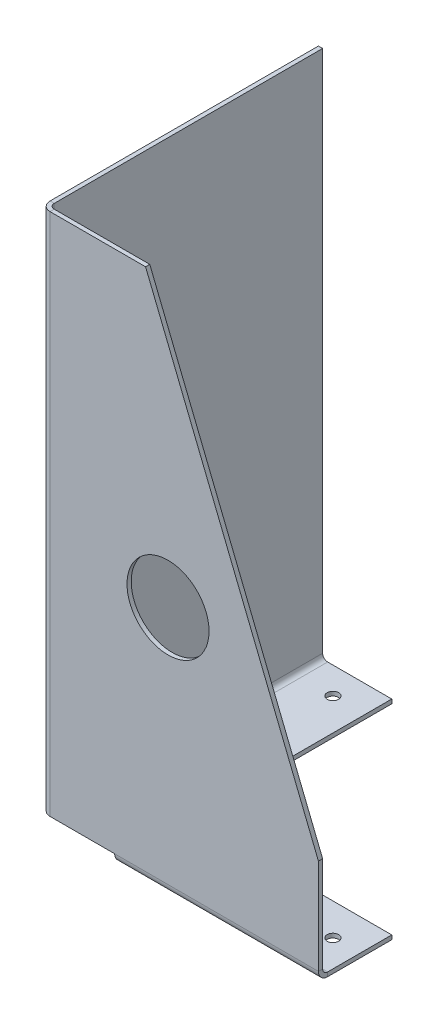
ISO-10303-21;
HEADER;
FILE_DESCRIPTION(('STEP AP214'),'2;1');
FILE_NAME('part.step','',(''),(''),'','','');
FILE_SCHEMA(('AUTOMOTIVE_DESIGN { 1 0 10303 214 1 1 1 1 }'));
ENDSEC;
DATA;
#1=APPLICATION_CONTEXT('core data for automotive mechanical design processes');
#2=APPLICATION_PROTOCOL_DEFINITION('international standard','automotive_design',2000,#1);
#3=PRODUCT_CONTEXT('',#1,'mechanical');
#4=PRODUCT('Part','Part','',(#3));
#5=PRODUCT_RELATED_PRODUCT_CATEGORY('part','',(#4));
#6=PRODUCT_DEFINITION_FORMATION('','',#4);
#7=PRODUCT_DEFINITION_CONTEXT('part definition',#1,'design');
#8=PRODUCT_DEFINITION('design','',#6,#7);
#9=PRODUCT_DEFINITION_SHAPE('','',#8);
#10=(LENGTH_UNIT() NAMED_UNIT(*) SI_UNIT(.MILLI.,.METRE.));
#11=(NAMED_UNIT(*) PLANE_ANGLE_UNIT() SI_UNIT($,.RADIAN.));
#12=(NAMED_UNIT(*) SI_UNIT($,.STERADIAN.) SOLID_ANGLE_UNIT());
#13=UNCERTAINTY_MEASURE_WITH_UNIT(LENGTH_MEASURE(1.E-05),#10,'distance_accuracy_value','');
#14=(GEOMETRIC_REPRESENTATION_CONTEXT(3) GLOBAL_UNCERTAINTY_ASSIGNED_CONTEXT((#13)) GLOBAL_UNIT_ASSIGNED_CONTEXT((#10,
#11,#12)) REPRESENTATION_CONTEXT('',''));
#15=CARTESIAN_POINT('',(0.,0.,0.));
#16=DIRECTION('',(0.,0.,1.));
#17=DIRECTION('',(1.,0.,0.));
#18=AXIS2_PLACEMENT_3D('',#15,#16,#17);
#19=CARTESIAN_POINT('',(0.,500.,0.));
#20=DIRECTION('',(0.,0.,-1.));
#21=DIRECTION('',(-1.,0.,0.));
#22=AXIS2_PLACEMENT_3D('',#19,#20,#21);
#23=PLANE('',#22);
#24=CARTESIAN_POINT('',(121.426292595906,228.989438893859,0.));
#25=DIRECTION('',(0.,0.,1.));
#26=DIRECTION('',(1.,0.,0.));
#27=AXIS2_PLACEMENT_3D('',#24,#25,#26);
#28=CIRCLE('',#27,39.1541773419602);
#29=CARTESIAN_POINT('',(160.580469937866,228.989438893859,0.));
#30=VERTEX_POINT('',#29);
#31=EDGE_CURVE('E476',#30,#30,#28,.T.);
#32=ORIENTED_EDGE('',*,*,#31,.F.);
#33=EDGE_LOOP('',(#32));
#34=FACE_BOUND('',#33,.T.);
#35=DIRECTION('',(0.374283014523139,-0.927314523254905,0.));
#36=VECTOR('',#35,1.);
#37=CARTESIAN_POINT('',(100.,500.,0.));
#38=LINE('',#37,#36);
#39=CARTESIAN_POINT('',(100.,500.,0.));
#40=VERTEX_POINT('',#39);
#41=CARTESIAN_POINT('',(265.,91.2,0.));
#42=VERTEX_POINT('',#41);
#43=EDGE_CURVE('E202',#40,#42,#38,.T.);
#44=ORIENTED_EDGE('',*,*,#43,.F.);
#45=DIRECTION('',(1.,0.,0.));
#46=VECTOR('',#45,1.);
#47=CARTESIAN_POINT('',(0.,500.,0.));
#48=LINE('',#47,#46);
#49=CARTESIAN_POINT('',(8.8,500.,0.));
#50=VERTEX_POINT('',#49);
#51=EDGE_CURVE('E240',#50,#40,#48,.T.);
#52=ORIENTED_EDGE('',*,*,#51,.F.);
#53=DIRECTION('',(0.,-1.,0.));
#54=VECTOR('',#53,1.);
#55=CARTESIAN_POINT('',(8.8,500.,0.));
#56=LINE('',#55,#54);
#57=CARTESIAN_POINT('',(8.8,0.,0.));
#58=VERTEX_POINT('',#57);
#59=EDGE_CURVE('E250',#50,#58,#56,.T.);
#60=ORIENTED_EDGE('',*,*,#59,.T.);
#61=DIRECTION('',(1.,0.,0.));
#62=VECTOR('',#61,1.);
#63=CARTESIAN_POINT('',(0.,0.,0.));
#64=LINE('',#63,#62);
#65=CARTESIAN_POINT('',(70.5,0.,0.));
#66=VERTEX_POINT('',#65);
#67=EDGE_CURVE('E280',#58,#66,#64,.T.);
#68=ORIENTED_EDGE('',*,*,#67,.T.);
#69=DIRECTION('',(-1.,0.,0.));
#70=VECTOR('',#69,1.);
#71=CARTESIAN_POINT('',(70.5,0.,0.));
#72=LINE('',#71,#70);
#73=CARTESIAN_POINT('',(265.,0.,0.));
#74=VERTEX_POINT('',#73);
#75=EDGE_CURVE('E377',#66,#74,#72,.F.);
#76=ORIENTED_EDGE('',*,*,#75,.T.);
#77=DIRECTION('',(0.,-1.,0.));
#78=VECTOR('',#77,1.);
#79=CARTESIAN_POINT('',(265.,500.,0.));
#80=LINE('',#79,#78);
#81=EDGE_CURVE('E222',#42,#74,#80,.T.);
#82=ORIENTED_EDGE('',*,*,#81,.F.);
#83=EDGE_LOOP('',(#44,#52,#60,#68,#76,#82));
#84=FACE_BOUND('',#83,.T.);
#85=ADVANCED_FACE('F77',(#34,#84),#23,.F.);
#86=CARTESIAN_POINT('',(265.,500.,-4.));
#87=DIRECTION('',(1.,0.,0.));
#88=DIRECTION('',(0.,0.,-1.));
#89=AXIS2_PLACEMENT_3D('',#86,#87,#88);
#90=PLANE('',#89);
#91=DIRECTION('',(0.,-1.,0.));
#92=VECTOR('',#91,1.);
#93=CARTESIAN_POINT('',(265.,500.,-4.));
#94=LINE('',#93,#92);
#95=CARTESIAN_POINT('',(265.,91.2,-4.));
#96=VERTEX_POINT('',#95);
#97=CARTESIAN_POINT('',(265.,0.,-4.00000000000001));
#98=VERTEX_POINT('',#97);
#99=EDGE_CURVE('E212',#96,#98,#94,.T.);
#100=ORIENTED_EDGE('',*,*,#99,.F.);
#101=DIRECTION('',(0.,0.,1.));
#102=VECTOR('',#101,1.);
#103=CARTESIAN_POINT('',(265.,91.2,0.));
#104=LINE('',#103,#102);
#105=EDGE_CURVE('E199',#42,#96,#104,.F.);
#106=ORIENTED_EDGE('',*,*,#105,.F.);
#107=ORIENTED_EDGE('',*,*,#81,.T.);
#108=DIRECTION('',(0.,0.,1.));
#109=VECTOR('',#108,1.);
#110=CARTESIAN_POINT('',(265.,0.,-4.));
#111=LINE('',#110,#109);
#112=EDGE_CURVE('E221',#98,#74,#111,.T.);
#113=ORIENTED_EDGE('',*,*,#112,.F.);
#114=EDGE_LOOP('',(#100,#106,#107,#113));
#115=FACE_BOUND('',#114,.T.);
#116=ADVANCED_FACE('F219',(#115),#90,.T.);
#117=CARTESIAN_POINT('',(0.,500.,-4.));
#118=DIRECTION('',(0.,0.,-1.));
#119=DIRECTION('',(-1.,0.,0.));
#120=AXIS2_PLACEMENT_3D('',#117,#118,#119);
#121=PLANE('',#120);
#122=CARTESIAN_POINT('',(121.426292595906,228.989438893859,-4.));
#123=DIRECTION('',(0.,0.,1.));
#124=DIRECTION('',(1.,0.,0.));
#125=AXIS2_PLACEMENT_3D('',#122,#123,#124);
#126=CIRCLE('',#125,39.1541773419602);
#127=CARTESIAN_POINT('',(160.580469937866,228.989438893859,-4.));
#128=VERTEX_POINT('',#127);
#129=EDGE_CURVE('E474',#128,#128,#126,.T.);
#130=ORIENTED_EDGE('',*,*,#129,.T.);
#131=EDGE_LOOP('',(#130));
#132=FACE_BOUND('',#131,.T.);
#133=DIRECTION('',(1.,0.,0.));
#134=VECTOR('',#133,1.);
#135=CARTESIAN_POINT('',(0.,500.,-4.));
#136=LINE('',#135,#134);
#137=CARTESIAN_POINT('',(8.8,500.,-4.));
#138=VERTEX_POINT('',#137);
#139=CARTESIAN_POINT('',(100.,500.,-4.));
#140=VERTEX_POINT('',#139);
#141=EDGE_CURVE('E216',#138,#140,#136,.T.);
#142=ORIENTED_EDGE('',*,*,#141,.T.);
#143=DIRECTION('',(0.374283014523139,-0.927314523254905,0.));
#144=VECTOR('',#143,1.);
#145=CARTESIAN_POINT('',(100.,500.,-4.));
#146=LINE('',#145,#144);
#147=EDGE_CURVE('E92',#140,#96,#146,.T.);
#148=ORIENTED_EDGE('',*,*,#147,.T.);
#149=ORIENTED_EDGE('',*,*,#99,.T.);
#150=DIRECTION('',(-1.,0.,0.));
#151=VECTOR('',#150,1.);
#152=CARTESIAN_POINT('',(70.5,0.,-3.99999999999998));
#153=LINE('',#152,#151);
#154=CARTESIAN_POINT('',(70.5,0.,-3.99999999999998));
#155=VERTEX_POINT('',#154);
#156=EDGE_CURVE('E387',#155,#98,#153,.F.);
#157=ORIENTED_EDGE('',*,*,#156,.F.);
#158=DIRECTION('',(1.,0.,0.));
#159=VECTOR('',#158,1.);
#160=CARTESIAN_POINT('',(0.,0.,-4.));
#161=LINE('',#160,#159);
#162=CARTESIAN_POINT('',(8.8,0.,-4.));
#163=VERTEX_POINT('',#162);
#164=EDGE_CURVE('E283',#163,#155,#161,.T.);
#165=ORIENTED_EDGE('',*,*,#164,.F.);
#166=DIRECTION('',(0.,-1.,0.));
#167=VECTOR('',#166,1.);
#168=CARTESIAN_POINT('',(8.8,500.,-4.));
#169=LINE('',#168,#167);
#170=EDGE_CURVE('E223',#138,#163,#169,.T.);
#171=ORIENTED_EDGE('',*,*,#170,.F.);
#172=EDGE_LOOP('',(#142,#148,#149,#157,#165,#171));
#173=FACE_BOUND('',#172,.T.);
#174=ADVANCED_FACE('F210',(#132,#173),#121,.T.);
#175=CARTESIAN_POINT('',(8.8,500.,-8.79999999999999));
#176=DIRECTION('',(0.,1.,0.));
#177=DIRECTION('',(1.,0.,0.));
#178=AXIS2_PLACEMENT_3D('',#175,#176,#177);
#179=PLANE('',#178);
#180=ORIENTED_EDGE('',*,*,#51,.T.);
#181=DIRECTION('',(0.,0.,1.));
#182=VECTOR('',#181,1.);
#183=CARTESIAN_POINT('',(100.,500.,0.));
#184=LINE('',#183,#182);
#185=EDGE_CURVE('E206',#40,#140,#184,.F.);
#186=ORIENTED_EDGE('',*,*,#185,.T.);
#187=ORIENTED_EDGE('',*,*,#141,.F.);
#188=DIRECTION('',(0.,0.,1.));
#189=VECTOR('',#188,1.);
#190=CARTESIAN_POINT('',(8.8,500.,-4.));
#191=LINE('',#190,#189);
#192=EDGE_CURVE('E85',#138,#50,#191,.T.);
#193=ORIENTED_EDGE('',*,*,#192,.T.);
#194=EDGE_LOOP('',(#180,#186,#187,#193));
#195=FACE_BOUND('',#194,.T.);
#196=ADVANCED_FACE('F238',(#195),#179,.T.);
#197=CARTESIAN_POINT('',(4.,0.,-8.79999999999998));
#198=DIRECTION('',(0.,-1.,0.));
#199=DIRECTION('',(0.,0.,-1.));
#200=AXIS2_PLACEMENT_3D('',#197,#198,#199);
#201=PLANE('',#200);
#202=ORIENTED_EDGE('',*,*,#164,.T.);
#203=DIRECTION('',(0.,0.,1.));
#204=VECTOR('',#203,1.);
#205=CARTESIAN_POINT('',(70.5,0.,-3.99999999999998));
#206=LINE('',#205,#204);
#207=EDGE_CURVE('E269',#155,#66,#206,.T.);
#208=ORIENTED_EDGE('',*,*,#207,.T.);
#209=ORIENTED_EDGE('',*,*,#67,.F.);
#210=DIRECTION('',(0.,0.,-1.));
#211=VECTOR('',#210,1.);
#212=CARTESIAN_POINT('',(8.8,0.,0.));
#213=LINE('',#212,#211);
#214=EDGE_CURVE('E234',#58,#163,#213,.T.);
#215=ORIENTED_EDGE('',*,*,#214,.T.);
#216=EDGE_LOOP('',(#202,#208,#209,#215));
#217=FACE_BOUND('',#216,.T.);
#218=ADVANCED_FACE('F397',(#217),#201,.T.);
#219=CARTESIAN_POINT('',(0.,500.,-8.79999999999997));
#220=DIRECTION('',(0.,1.,0.));
#221=DIRECTION('',(0.,0.,1.));
#222=AXIS2_PLACEMENT_3D('',#219,#220,#221);
#223=PLANE('',#222);
#224=DIRECTION('',(1.,0.,0.));
#225=VECTOR('',#224,1.);
#226=CARTESIAN_POINT('',(0.,500.,-8.79999999999997));
#227=LINE('',#226,#225);
#228=CARTESIAN_POINT('',(0.,500.,-8.79999999999997));
#229=VERTEX_POINT('',#228);
#230=CARTESIAN_POINT('',(4.,500.,-8.79999999999998));
#231=VERTEX_POINT('',#230);
#232=EDGE_CURVE('E13',#229,#231,#227,.T.);
#233=ORIENTED_EDGE('',*,*,#232,.F.);
#234=CARTESIAN_POINT('',(8.8,500.,-8.79999999999999));
#235=DIRECTION('',(0.,-1.,0.));
#236=DIRECTION('',(0.,0.,-1.));
#237=AXIS2_PLACEMENT_3D('',#234,#235,#236);
#238=CIRCLE('',#237,8.8);
#239=EDGE_CURVE('E245',#229,#50,#238,.F.);
#240=ORIENTED_EDGE('',*,*,#239,.T.);
#241=ORIENTED_EDGE('',*,*,#192,.F.);
#242=CARTESIAN_POINT('',(8.8,500.,-8.79999999999999));
#243=DIRECTION('',(0.,1.,0.));
#244=DIRECTION('',(1.,0.,0.));
#245=AXIS2_PLACEMENT_3D('',#242,#243,#244);
#246=CIRCLE('',#245,4.8);
#247=EDGE_CURVE('E264',#231,#138,#246,.T.);
#248=ORIENTED_EDGE('',*,*,#247,.F.);
#249=EDGE_LOOP('',(#233,#240,#241,#248));
#250=FACE_BOUND('',#249,.T.);
#251=ADVANCED_FACE('F79',(#250),#223,.T.);
#252=CARTESIAN_POINT('',(8.8,500.,-4.));
#253=DIRECTION('',(0.,1.,0.));
#254=DIRECTION('',(0.,0.,1.));
#255=AXIS2_PLACEMENT_3D('',#252,#253,#254);
#256=PLANE('',#255);
#257=DIRECTION('',(0.,0.,1.));
#258=VECTOR('',#257,1.);
#259=CARTESIAN_POINT('',(0.,500.,-265.));
#260=LINE('',#259,#258);
#261=CARTESIAN_POINT('',(0.,500.,-265.));
#262=VERTEX_POINT('',#261);
#263=EDGE_CURVE('E251',#262,#229,#260,.T.);
#264=ORIENTED_EDGE('',*,*,#263,.T.);
#265=ORIENTED_EDGE('',*,*,#232,.T.);
#266=DIRECTION('',(0.,0.,1.));
#267=VECTOR('',#266,1.);
#268=CARTESIAN_POINT('',(4.,500.,-265.));
#269=LINE('',#268,#267);
#270=CARTESIAN_POINT('',(4.,500.,-265.));
#271=VERTEX_POINT('',#270);
#272=EDGE_CURVE('E273',#271,#231,#269,.T.);
#273=ORIENTED_EDGE('',*,*,#272,.F.);
#274=DIRECTION('',(1.,0.,0.));
#275=VECTOR('',#274,1.);
#276=CARTESIAN_POINT('',(0.,500.,-265.));
#277=LINE('',#276,#275);
#278=EDGE_CURVE('E276',#262,#271,#277,.T.);
#279=ORIENTED_EDGE('',*,*,#278,.F.);
#280=EDGE_LOOP('',(#264,#265,#273,#279));
#281=FACE_BOUND('',#280,.T.);
#282=ADVANCED_FACE('F447',(#281),#256,.T.);
#283=CARTESIAN_POINT('',(8.8,0.,0.));
#284=DIRECTION('',(0.,-1.,0.));
#285=DIRECTION('',(0.,0.,-1.));
#286=AXIS2_PLACEMENT_3D('',#283,#284,#285);
#287=PLANE('',#286);
#288=ORIENTED_EDGE('',*,*,#214,.F.);
#289=CARTESIAN_POINT('',(8.8,0.,-8.79999999999999));
#290=DIRECTION('',(0.,-1.,0.));
#291=DIRECTION('',(0.,0.,-1.));
#292=AXIS2_PLACEMENT_3D('',#289,#290,#291);
#293=CIRCLE('',#292,8.8);
#294=CARTESIAN_POINT('',(0.,0.,-8.79999999999997));
#295=VERTEX_POINT('',#294);
#296=EDGE_CURVE('E257',#295,#58,#293,.F.);
#297=ORIENTED_EDGE('',*,*,#296,.F.);
#298=DIRECTION('',(-1.,0.,0.));
#299=VECTOR('',#298,1.);
#300=CARTESIAN_POINT('',(4.,0.,-8.79999999999998));
#301=LINE('',#300,#299);
#302=CARTESIAN_POINT('',(4.,0.,-8.79999999999997));
#303=VERTEX_POINT('',#302);
#304=EDGE_CURVE('E225',#303,#295,#301,.T.);
#305=ORIENTED_EDGE('',*,*,#304,.F.);
#306=CARTESIAN_POINT('',(8.8,0.,-8.79999999999999));
#307=DIRECTION('',(0.,1.,0.));
#308=DIRECTION('',(1.,0.,0.));
#309=AXIS2_PLACEMENT_3D('',#306,#307,#308);
#310=CIRCLE('',#309,4.8);
#311=EDGE_CURVE('E286',#303,#163,#310,.T.);
#312=ORIENTED_EDGE('',*,*,#311,.T.);
#313=EDGE_LOOP('',(#288,#297,#305,#312));
#314=FACE_BOUND('',#313,.T.);
#315=ADVANCED_FACE('F313',(#314),#287,.T.);
#316=CARTESIAN_POINT('',(8.8,500.,-8.79999999999999));
#317=DIRECTION('',(0.,-1.,0.));
#318=DIRECTION('',(0.,0.,-1.));
#319=AXIS2_PLACEMENT_3D('',#316,#317,#318);
#320=CYLINDRICAL_SURFACE('',#319,4.8);
#321=ORIENTED_EDGE('',*,*,#311,.F.);
#322=DIRECTION('',(0.,-1.,0.));
#323=VECTOR('',#322,1.);
#324=CARTESIAN_POINT('',(4.,500.,-8.79999999999998));
#325=LINE('',#324,#323);
#326=EDGE_CURVE('E228',#231,#303,#325,.T.);
#327=ORIENTED_EDGE('',*,*,#326,.F.);
#328=ORIENTED_EDGE('',*,*,#247,.T.);
#329=ORIENTED_EDGE('',*,*,#170,.T.);
#330=EDGE_LOOP('',(#321,#327,#328,#329));
#331=FACE_BOUND('',#330,.T.);
#332=ADVANCED_FACE('F309',(#331),#320,.F.);
#333=CARTESIAN_POINT('',(4.,500.,-265.));
#334=DIRECTION('',(1.,0.,0.));
#335=DIRECTION('',(0.,0.,-1.));
#336=AXIS2_PLACEMENT_3D('',#333,#334,#335);
#337=PLANE('',#336);
#338=DIRECTION('',(0.,0.,1.));
#339=VECTOR('',#338,1.);
#340=CARTESIAN_POINT('',(4.,0.,-265.));
#341=LINE('',#340,#339);
#342=CARTESIAN_POINT('',(4.,0.,-265.));
#343=VERTEX_POINT('',#342);
#344=EDGE_CURVE('E289',#343,#303,#341,.T.);
#345=ORIENTED_EDGE('',*,*,#344,.F.);
#346=DIRECTION('',(0.,-1.,0.));
#347=VECTOR('',#346,1.);
#348=CARTESIAN_POINT('',(4.,500.,-265.));
#349=LINE('',#348,#347);
#350=EDGE_CURVE('E299',#271,#343,#349,.T.);
#351=ORIENTED_EDGE('',*,*,#350,.F.);
#352=ORIENTED_EDGE('',*,*,#272,.T.);
#353=ORIENTED_EDGE('',*,*,#326,.T.);
#354=EDGE_LOOP('',(#345,#351,#352,#353));
#355=FACE_BOUND('',#354,.T.);
#356=ADVANCED_FACE('F306',(#355),#337,.T.);
#357=CARTESIAN_POINT('',(0.,500.,-265.));
#358=DIRECTION('',(0.,0.,-1.));
#359=DIRECTION('',(-1.,0.,0.));
#360=AXIS2_PLACEMENT_3D('',#357,#358,#359);
#361=PLANE('',#360);
#362=DIRECTION('',(1.,0.,0.));
#363=VECTOR('',#362,1.);
#364=CARTESIAN_POINT('',(0.,0.,-265.));
#365=LINE('',#364,#363);
#366=CARTESIAN_POINT('',(0.,0.,-265.));
#367=VERTEX_POINT('',#366);
#368=EDGE_CURVE('E291',#367,#343,#365,.T.);
#369=ORIENTED_EDGE('',*,*,#368,.F.);
#370=DIRECTION('',(0.,-1.,0.));
#371=VECTOR('',#370,1.);
#372=CARTESIAN_POINT('',(0.,500.,-265.));
#373=LINE('',#372,#371);
#374=EDGE_CURVE('E296',#262,#367,#373,.T.);
#375=ORIENTED_EDGE('',*,*,#374,.F.);
#376=ORIENTED_EDGE('',*,*,#278,.T.);
#377=ORIENTED_EDGE('',*,*,#350,.T.);
#378=EDGE_LOOP('',(#369,#375,#376,#377));
#379=FACE_BOUND('',#378,.T.);
#380=ADVANCED_FACE('F455',(#379),#361,.T.);
#381=CARTESIAN_POINT('',(0.,500.,-265.));
#382=DIRECTION('',(1.,0.,0.));
#383=DIRECTION('',(0.,0.,-1.));
#384=AXIS2_PLACEMENT_3D('',#381,#382,#383);
#385=PLANE('',#384);
#386=DIRECTION('',(0.,0.,1.));
#387=VECTOR('',#386,1.);
#388=CARTESIAN_POINT('',(0.,0.,-265.));
#389=LINE('',#388,#387);
#390=EDGE_CURVE('E266',#367,#295,#389,.T.);
#391=ORIENTED_EDGE('',*,*,#390,.T.);
#392=DIRECTION('',(0.,-1.,0.));
#393=VECTOR('',#392,1.);
#394=CARTESIAN_POINT('',(0.,500.,-8.79999999999997));
#395=LINE('',#394,#393);
#396=EDGE_CURVE('E261',#229,#295,#395,.T.);
#397=ORIENTED_EDGE('',*,*,#396,.F.);
#398=ORIENTED_EDGE('',*,*,#263,.F.);
#399=ORIENTED_EDGE('',*,*,#374,.T.);
#400=EDGE_LOOP('',(#391,#397,#398,#399));
#401=FACE_BOUND('',#400,.T.);
#402=ADVANCED_FACE('F324',(#401),#385,.F.);
#403=CARTESIAN_POINT('',(8.8,500.,-8.79999999999999));
#404=DIRECTION('',(0.,-1.,0.));
#405=DIRECTION('',(0.,0.,-1.));
#406=AXIS2_PLACEMENT_3D('',#403,#404,#405);
#407=CYLINDRICAL_SURFACE('',#406,8.8);
#408=ORIENTED_EDGE('',*,*,#296,.T.);
#409=ORIENTED_EDGE('',*,*,#59,.F.);
#410=ORIENTED_EDGE('',*,*,#239,.F.);
#411=ORIENTED_EDGE('',*,*,#396,.T.);
#412=EDGE_LOOP('',(#408,#409,#410,#411));
#413=FACE_BOUND('',#412,.T.);
#414=ADVANCED_FACE('F255',(#413),#407,.T.);
#415=CARTESIAN_POINT('',(265.,0.,-8.80000000000001));
#416=DIRECTION('',(1.,0.,0.));
#417=DIRECTION('',(0.,0.,-1.));
#418=AXIS2_PLACEMENT_3D('',#415,#416,#417);
#419=PLANE('',#418);
#420=DIRECTION('',(0.,1.,0.));
#421=VECTOR('',#420,1.);
#422=CARTESIAN_POINT('',(265.,-8.8,-8.79999999999997));
#423=LINE('',#422,#421);
#424=CARTESIAN_POINT('',(265.,-4.8,-8.79999999999999));
#425=VERTEX_POINT('',#424);
#426=CARTESIAN_POINT('',(265.,-8.8,-8.79999999999998));
#427=VERTEX_POINT('',#426);
#428=EDGE_CURVE('E340',#425,#427,#423,.F.);
#429=ORIENTED_EDGE('',*,*,#428,.F.);
#430=CARTESIAN_POINT('',(265.,0.,-8.80000000000001));
#431=DIRECTION('',(-1.,0.,0.));
#432=DIRECTION('',(0.,0.,1.));
#433=AXIS2_PLACEMENT_3D('',#430,#431,#432);
#434=CIRCLE('',#433,4.8);
#435=EDGE_CURVE('E384',#98,#425,#434,.F.);
#436=ORIENTED_EDGE('',*,*,#435,.F.);
#437=ORIENTED_EDGE('',*,*,#112,.T.);
#438=CARTESIAN_POINT('',(265.,0.,-8.80000000000001));
#439=DIRECTION('',(-1.,0.,0.));
#440=DIRECTION('',(0.,0.,1.));
#441=AXIS2_PLACEMENT_3D('',#438,#439,#440);
#442=CIRCLE('',#441,8.8);
#443=EDGE_CURVE('E380',#74,#427,#442,.F.);
#444=ORIENTED_EDGE('',*,*,#443,.T.);
#445=EDGE_LOOP('',(#429,#436,#437,#444));
#446=FACE_BOUND('',#445,.T.);
#447=ADVANCED_FACE('F403',(#446),#419,.T.);
#448=CARTESIAN_POINT('',(70.5,0.,-8.79999999999997));
#449=DIRECTION('',(1.,0.,0.));
#450=DIRECTION('',(0.,0.,-1.));
#451=AXIS2_PLACEMENT_3D('',#448,#449,#450);
#452=PLANE('',#451);
#453=CARTESIAN_POINT('',(70.5,0.,-8.79999999999997));
#454=DIRECTION('',(-1.,0.,0.));
#455=DIRECTION('',(0.,0.,1.));
#456=AXIS2_PLACEMENT_3D('',#453,#454,#455);
#457=CIRCLE('',#456,4.8);
#458=CARTESIAN_POINT('',(70.5,-4.8,-8.79999999999996));
#459=VERTEX_POINT('',#458);
#460=EDGE_CURVE('E351',#459,#155,#457,.T.);
#461=ORIENTED_EDGE('',*,*,#460,.F.);
#462=DIRECTION('',(0.,1.,0.));
#463=VECTOR('',#462,1.);
#464=CARTESIAN_POINT('',(70.5,-4.8,-8.79999999999997));
#465=LINE('',#464,#463);
#466=CARTESIAN_POINT('',(70.5,-8.8,-8.79999999999996));
#467=VERTEX_POINT('',#466);
#468=EDGE_CURVE('E371',#459,#467,#465,.F.);
#469=ORIENTED_EDGE('',*,*,#468,.T.);
#470=CARTESIAN_POINT('',(70.5,0.,-8.79999999999997));
#471=DIRECTION('',(-1.,0.,0.));
#472=DIRECTION('',(0.,0.,1.));
#473=AXIS2_PLACEMENT_3D('',#470,#471,#472);
#474=CIRCLE('',#473,8.8);
#475=EDGE_CURVE('E100',#467,#66,#474,.T.);
#476=ORIENTED_EDGE('',*,*,#475,.T.);
#477=ORIENTED_EDGE('',*,*,#207,.F.);
#478=EDGE_LOOP('',(#461,#469,#476,#477));
#479=FACE_BOUND('',#478,.T.);
#480=ADVANCED_FACE('F422',(#479),#452,.F.);
#481=CARTESIAN_POINT('',(70.5,0.,-8.79999999999997));
#482=DIRECTION('',(-1.,0.,0.));
#483=DIRECTION('',(0.,-1.,0.));
#484=AXIS2_PLACEMENT_3D('',#481,#482,#483);
#485=CYLINDRICAL_SURFACE('',#484,8.8);
#486=ORIENTED_EDGE('',*,*,#75,.F.);
#487=ORIENTED_EDGE('',*,*,#475,.F.);
#488=DIRECTION('',(-1.,0.,0.));
#489=VECTOR('',#488,1.);
#490=CARTESIAN_POINT('',(265.,-8.8,-8.79999999999997));
#491=LINE('',#490,#489);
#492=EDGE_CURVE('E369',#467,#427,#491,.F.);
#493=ORIENTED_EDGE('',*,*,#492,.T.);
#494=ORIENTED_EDGE('',*,*,#443,.F.);
#495=EDGE_LOOP('',(#486,#487,#493,#494));
#496=FACE_BOUND('',#495,.T.);
#497=ADVANCED_FACE('F400',(#496),#485,.T.);
#498=CARTESIAN_POINT('',(70.5,0.,-8.79999999999997));
#499=DIRECTION('',(-1.,0.,0.));
#500=DIRECTION('',(0.,-1.,0.));
#501=AXIS2_PLACEMENT_3D('',#498,#499,#500);
#502=CYLINDRICAL_SURFACE('',#501,4.8);
#503=ORIENTED_EDGE('',*,*,#156,.T.);
#504=ORIENTED_EDGE('',*,*,#435,.T.);
#505=DIRECTION('',(-1.,0.,0.));
#506=VECTOR('',#505,1.);
#507=CARTESIAN_POINT('',(265.,-4.8,-8.79999999999998));
#508=LINE('',#507,#506);
#509=EDGE_CURVE('E373',#425,#459,#508,.T.);
#510=ORIENTED_EDGE('',*,*,#509,.T.);
#511=ORIENTED_EDGE('',*,*,#460,.T.);
#512=EDGE_LOOP('',(#503,#504,#510,#511));
#513=FACE_BOUND('',#512,.T.);
#514=ADVANCED_FACE('F391',(#513),#502,.F.);
#515=CARTESIAN_POINT('',(70.5,-8.80000000000021,-70.));
#516=DIRECTION('',(1.,0.,0.));
#517=DIRECTION('',(0.,0.,-1.));
#518=AXIS2_PLACEMENT_3D('',#515,#516,#517);
#519=PLANE('',#518);
#520=ORIENTED_EDGE('',*,*,#468,.F.);
#521=DIRECTION('',(0.,0.,1.));
#522=VECTOR('',#521,1.);
#523=CARTESIAN_POINT('',(70.5,-4.80000000000021,-70.));
#524=LINE('',#523,#522);
#525=CARTESIAN_POINT('',(70.5,-4.80000000000021,-70.));
#526=VERTEX_POINT('',#525);
#527=EDGE_CURVE('E367',#459,#526,#524,.F.);
#528=ORIENTED_EDGE('',*,*,#527,.T.);
#529=DIRECTION('',(0.,1.,0.));
#530=VECTOR('',#529,1.);
#531=CARTESIAN_POINT('',(70.5,-8.80000000000021,-70.));
#532=LINE('',#531,#530);
#533=CARTESIAN_POINT('',(70.5,-8.80000000000021,-70.));
#534=VERTEX_POINT('',#533);
#535=EDGE_CURVE('E348',#534,#526,#532,.T.);
#536=ORIENTED_EDGE('',*,*,#535,.F.);
#537=DIRECTION('',(0.,0.,-1.));
#538=VECTOR('',#537,1.);
#539=CARTESIAN_POINT('',(70.5,-8.79999999999997,0.));
#540=LINE('',#539,#538);
#541=EDGE_CURVE('E360',#467,#534,#540,.T.);
#542=ORIENTED_EDGE('',*,*,#541,.F.);
#543=EDGE_LOOP('',(#520,#528,#536,#542));
#544=FACE_BOUND('',#543,.T.);
#545=ADVANCED_FACE('F421',(#544),#519,.F.);
#546=CARTESIAN_POINT('',(265.,-8.79999999999998,-3.99999999999999));
#547=DIRECTION('',(-1.,0.,0.));
#548=DIRECTION('',(0.,0.,1.));
#549=AXIS2_PLACEMENT_3D('',#546,#547,#548);
#550=PLANE('',#549);
#551=ORIENTED_EDGE('',*,*,#428,.T.);
#552=DIRECTION('',(0.,0.,1.));
#553=VECTOR('',#552,1.);
#554=CARTESIAN_POINT('',(265.,-8.79999999999997,0.));
#555=LINE('',#554,#553);
#556=CARTESIAN_POINT('',(265.,-8.80000000000021,-70.));
#557=VERTEX_POINT('',#556);
#558=EDGE_CURVE('E355',#557,#427,#555,.T.);
#559=ORIENTED_EDGE('',*,*,#558,.F.);
#560=DIRECTION('',(0.,1.,0.));
#561=VECTOR('',#560,1.);
#562=CARTESIAN_POINT('',(265.,-8.80000000000021,-70.));
#563=LINE('',#562,#561);
#564=CARTESIAN_POINT('',(265.,-4.80000000000021,-70.));
#565=VERTEX_POINT('',#564);
#566=EDGE_CURVE('E352',#557,#565,#563,.T.);
#567=ORIENTED_EDGE('',*,*,#566,.T.);
#568=DIRECTION('',(0.,0.,-1.));
#569=VECTOR('',#568,1.);
#570=CARTESIAN_POINT('',(265.,-4.79999999999998,-4.));
#571=LINE('',#570,#569);
#572=EDGE_CURVE('E362',#565,#425,#571,.F.);
#573=ORIENTED_EDGE('',*,*,#572,.T.);
#574=EDGE_LOOP('',(#551,#559,#567,#573));
#575=FACE_BOUND('',#574,.T.);
#576=ADVANCED_FACE('F406',(#575),#550,.F.);
#577=CARTESIAN_POINT('',(0.,-8.79999999999997,0.));
#578=DIRECTION('',(0.,1.,0.));
#579=DIRECTION('',(0.,0.,1.));
#580=AXIS2_PLACEMENT_3D('',#577,#578,#579);
#581=PLANE('',#580);
#582=CARTESIAN_POINT('',(239.4,-8.8000000000008,-39.4));
#583=DIRECTION('',(0.,1.,0.));
#584=DIRECTION('',(-1.,0.,0.));
#585=AXIS2_PLACEMENT_3D('',#582,#583,#584);
#586=CIRCLE('',#585,5.50000000000002);
#587=CARTESIAN_POINT('',(233.9,-8.80000000000078,-39.4));
#588=VERTEX_POINT('',#587);
#589=EDGE_CURVE('E497',#588,#588,#586,.T.);
#590=ORIENTED_EDGE('',*,*,#589,.T.);
#591=EDGE_LOOP('',(#590));
#592=FACE_BOUND('',#591,.T.);
#593=ORIENTED_EDGE('',*,*,#492,.F.);
#594=ORIENTED_EDGE('',*,*,#541,.T.);
#595=DIRECTION('',(1.,0.,0.));
#596=VECTOR('',#595,1.);
#597=CARTESIAN_POINT('',(0.,-8.80000000000021,-70.));
#598=LINE('',#597,#596);
#599=EDGE_CURVE('E358',#534,#557,#598,.T.);
#600=ORIENTED_EDGE('',*,*,#599,.T.);
#601=ORIENTED_EDGE('',*,*,#558,.T.);
#602=EDGE_LOOP('',(#593,#594,#600,#601));
#603=FACE_BOUND('',#602,.T.);
#604=ADVANCED_FACE('F409',(#592,#603),#581,.F.);
#605=CARTESIAN_POINT('',(0.,-4.79999999999997,0.));
#606=DIRECTION('',(0.,1.,0.));
#607=DIRECTION('',(0.,0.,1.));
#608=AXIS2_PLACEMENT_3D('',#605,#606,#607);
#609=PLANE('',#608);
#610=CARTESIAN_POINT('',(239.4,-4.8000000000008,-39.4));
#611=DIRECTION('',(0.,1.,0.));
#612=DIRECTION('',(-1.,0.,0.));
#613=AXIS2_PLACEMENT_3D('',#610,#611,#612);
#614=CIRCLE('',#613,5.50000000000002);
#615=CARTESIAN_POINT('',(233.9,-4.80000000000078,-39.4));
#616=VERTEX_POINT('',#615);
#617=EDGE_CURVE('E482',#616,#616,#614,.T.);
#618=ORIENTED_EDGE('',*,*,#617,.F.);
#619=EDGE_LOOP('',(#618));
#620=FACE_BOUND('',#619,.T.);
#621=ORIENTED_EDGE('',*,*,#527,.F.);
#622=ORIENTED_EDGE('',*,*,#509,.F.);
#623=ORIENTED_EDGE('',*,*,#572,.F.);
#624=DIRECTION('',(-1.,0.,0.));
#625=VECTOR('',#624,1.);
#626=CARTESIAN_POINT('',(265.,-4.80000000000021,-70.));
#627=LINE('',#626,#625);
#628=EDGE_CURVE('E365',#526,#565,#627,.F.);
#629=ORIENTED_EDGE('',*,*,#628,.F.);
#630=EDGE_LOOP('',(#621,#622,#623,#629));
#631=FACE_BOUND('',#630,.T.);
#632=ADVANCED_FACE('F419',(#620,#631),#609,.T.);
#633=CARTESIAN_POINT('',(265.,-8.80000000000021,-70.));
#634=DIRECTION('',(0.,0.,1.));
#635=DIRECTION('',(0.,-1.,0.));
#636=AXIS2_PLACEMENT_3D('',#633,#634,#635);
#637=PLANE('',#636);
#638=ORIENTED_EDGE('',*,*,#628,.T.);
#639=ORIENTED_EDGE('',*,*,#566,.F.);
#640=ORIENTED_EDGE('',*,*,#599,.F.);
#641=ORIENTED_EDGE('',*,*,#535,.T.);
#642=EDGE_LOOP('',(#638,#639,#640,#641));
#643=FACE_BOUND('',#642,.T.);
#644=ADVANCED_FACE('F415',(#643),#637,.F.);
#645=CARTESIAN_POINT('',(8.8,0.,-8.79999999999997));
#646=DIRECTION('',(0.,0.,1.));
#647=DIRECTION('',(1.,0.,0.));
#648=AXIS2_PLACEMENT_3D('',#645,#646,#647);
#649=PLANE('',#648);
#650=DIRECTION('',(0.,1.,0.));
#651=VECTOR('',#650,1.);
#652=CARTESIAN_POINT('',(8.79999999999997,-8.8,-8.79999999999998));
#653=LINE('',#652,#651);
#654=CARTESIAN_POINT('',(8.79999999999998,-4.8,-8.79999999999997));
#655=VERTEX_POINT('',#654);
#656=CARTESIAN_POINT('',(8.79999999999997,-8.8,-8.79999999999997));
#657=VERTEX_POINT('',#656);
#658=EDGE_CURVE('E487',#655,#657,#653,.F.);
#659=ORIENTED_EDGE('',*,*,#658,.F.);
#660=CARTESIAN_POINT('',(8.8,0.,-8.79999999999997));
#661=DIRECTION('',(0.,0.,-1.));
#662=DIRECTION('',(-1.,0.,0.));
#663=AXIS2_PLACEMENT_3D('',#660,#661,#662);
#664=CIRCLE('',#663,4.8);
#665=EDGE_CURVE('E321',#303,#655,#664,.F.);
#666=ORIENTED_EDGE('',*,*,#665,.F.);
#667=ORIENTED_EDGE('',*,*,#304,.T.);
#668=CARTESIAN_POINT('',(8.8,0.,-8.79999999999997));
#669=DIRECTION('',(0.,0.,-1.));
#670=DIRECTION('',(-1.,0.,0.));
#671=AXIS2_PLACEMENT_3D('',#668,#669,#670);
#672=CIRCLE('',#671,8.8);
#673=EDGE_CURVE('E318',#295,#657,#672,.F.);
#674=ORIENTED_EDGE('',*,*,#673,.T.);
#675=EDGE_LOOP('',(#659,#666,#667,#674));
#676=FACE_BOUND('',#675,.T.);
#677=ADVANCED_FACE('F317',(#676),#649,.T.);
#678=CARTESIAN_POINT('',(8.8,0.,-265.));
#679=DIRECTION('',(0.,0.,1.));
#680=DIRECTION('',(1.,0.,0.));
#681=AXIS2_PLACEMENT_3D('',#678,#679,#680);
#682=PLANE('',#681);
#683=CARTESIAN_POINT('',(8.8,0.,-265.));
#684=DIRECTION('',(0.,0.,-1.));
#685=DIRECTION('',(-1.,0.,0.));
#686=AXIS2_PLACEMENT_3D('',#683,#684,#685);
#687=CIRCLE('',#686,4.8);
#688=CARTESIAN_POINT('',(8.79999999999998,-4.8,-265.));
#689=VERTEX_POINT('',#688);
#690=EDGE_CURVE('E342',#689,#343,#687,.T.);
#691=ORIENTED_EDGE('',*,*,#690,.F.);
#692=DIRECTION('',(0.,1.,0.));
#693=VECTOR('',#692,1.);
#694=CARTESIAN_POINT('',(8.79999999999998,-4.8,-265.));
#695=LINE('',#694,#693);
#696=CARTESIAN_POINT('',(8.79999999999997,-8.8,-265.));
#697=VERTEX_POINT('',#696);
#698=EDGE_CURVE('E337',#689,#697,#695,.F.);
#699=ORIENTED_EDGE('',*,*,#698,.T.);
#700=CARTESIAN_POINT('',(8.8,0.,-265.));
#701=DIRECTION('',(0.,0.,-1.));
#702=DIRECTION('',(-1.,0.,0.));
#703=AXIS2_PLACEMENT_3D('',#700,#701,#702);
#704=CIRCLE('',#703,8.8);
#705=EDGE_CURVE('E330',#697,#367,#704,.T.);
#706=ORIENTED_EDGE('',*,*,#705,.T.);
#707=ORIENTED_EDGE('',*,*,#368,.T.);
#708=EDGE_LOOP('',(#691,#699,#706,#707));
#709=FACE_BOUND('',#708,.T.);
#710=ADVANCED_FACE('F334',(#709),#682,.F.);
#711=CARTESIAN_POINT('',(8.8,0.,-265.));
#712=DIRECTION('',(0.,0.,-1.));
#713=DIRECTION('',(0.,-1.,0.));
#714=AXIS2_PLACEMENT_3D('',#711,#712,#713);
#715=CYLINDRICAL_SURFACE('',#714,8.8);
#716=ORIENTED_EDGE('',*,*,#390,.F.);
#717=ORIENTED_EDGE('',*,*,#705,.F.);
#718=DIRECTION('',(0.,0.,-1.));
#719=VECTOR('',#718,1.);
#720=CARTESIAN_POINT('',(8.79999999999997,-8.8,-8.79999999999999));
#721=LINE('',#720,#719);
#722=EDGE_CURVE('E521',#697,#657,#721,.F.);
#723=ORIENTED_EDGE('',*,*,#722,.T.);
#724=ORIENTED_EDGE('',*,*,#673,.F.);
#725=EDGE_LOOP('',(#716,#717,#723,#724));
#726=FACE_BOUND('',#725,.T.);
#727=ADVANCED_FACE('F329',(#726),#715,.T.);
#728=CARTESIAN_POINT('',(8.8,0.,-265.));
#729=DIRECTION('',(0.,0.,-1.));
#730=DIRECTION('',(0.,-1.,0.));
#731=AXIS2_PLACEMENT_3D('',#728,#729,#730);
#732=CYLINDRICAL_SURFACE('',#731,4.8);
#733=ORIENTED_EDGE('',*,*,#344,.T.);
#734=ORIENTED_EDGE('',*,*,#665,.T.);
#735=DIRECTION('',(0.,0.,-1.));
#736=VECTOR('',#735,1.);
#737=CARTESIAN_POINT('',(8.79999999999998,-4.8,-8.79999999999999));
#738=LINE('',#737,#736);
#739=EDGE_CURVE('E524',#655,#689,#738,.T.);
#740=ORIENTED_EDGE('',*,*,#739,.T.);
#741=ORIENTED_EDGE('',*,*,#690,.T.);
#742=EDGE_LOOP('',(#733,#734,#740,#741));
#743=FACE_BOUND('',#742,.T.);
#744=ADVANCED_FACE('F543',(#743),#732,.F.);
#745=CARTESIAN_POINT('',(70.,-8.80000000000021,-265.));
#746=DIRECTION('',(0.,0.,1.));
#747=DIRECTION('',(0.,-1.,0.));
#748=AXIS2_PLACEMENT_3D('',#745,#746,#747);
#749=PLANE('',#748);
#750=ORIENTED_EDGE('',*,*,#698,.F.);
#751=DIRECTION('',(-1.,0.,0.));
#752=VECTOR('',#751,1.);
#753=CARTESIAN_POINT('',(70.,-4.80000000000021,-265.));
#754=LINE('',#753,#752);
#755=CARTESIAN_POINT('',(70.,-4.80000000000021,-265.));
#756=VERTEX_POINT('',#755);
#757=EDGE_CURVE('E519',#689,#756,#754,.F.);
#758=ORIENTED_EDGE('',*,*,#757,.T.);
#759=DIRECTION('',(0.,1.,0.));
#760=VECTOR('',#759,1.);
#761=CARTESIAN_POINT('',(70.,-8.80000000000021,-265.));
#762=LINE('',#761,#760);
#763=CARTESIAN_POINT('',(70.,-8.80000000000021,-265.));
#764=VERTEX_POINT('',#763);
#765=EDGE_CURVE('E347',#764,#756,#762,.T.);
#766=ORIENTED_EDGE('',*,*,#765,.F.);
#767=DIRECTION('',(1.,0.,0.));
#768=VECTOR('',#767,1.);
#769=CARTESIAN_POINT('',(0.,-8.79999999999997,-265.));
#770=LINE('',#769,#768);
#771=EDGE_CURVE('E512',#697,#764,#770,.T.);
#772=ORIENTED_EDGE('',*,*,#771,.F.);
#773=EDGE_LOOP('',(#750,#758,#766,#772));
#774=FACE_BOUND('',#773,.T.);
#775=ADVANCED_FACE('F545',(#774),#749,.F.);
#776=CARTESIAN_POINT('',(3.99999999999999,-8.79999999999998,-8.79999999999998));
#777=DIRECTION('',(0.,0.,-1.));
#778=DIRECTION('',(-1.,0.,0.));
#779=AXIS2_PLACEMENT_3D('',#776,#777,#778);
#780=PLANE('',#779);
#781=ORIENTED_EDGE('',*,*,#658,.T.);
#782=DIRECTION('',(-1.,0.,0.));
#783=VECTOR('',#782,1.);
#784=CARTESIAN_POINT('',(0.,-8.79999999999997,-8.79999999999998));
#785=LINE('',#784,#783);
#786=CARTESIAN_POINT('',(70.,-8.80000000000021,-8.8));
#787=VERTEX_POINT('',#786);
#788=EDGE_CURVE('E507',#787,#657,#785,.T.);
#789=ORIENTED_EDGE('',*,*,#788,.F.);
#790=DIRECTION('',(0.,1.,0.));
#791=VECTOR('',#790,1.);
#792=CARTESIAN_POINT('',(70.,-8.80000000000021,-8.8));
#793=LINE('',#792,#791);
#794=CARTESIAN_POINT('',(70.,-4.80000000000021,-8.8));
#795=VERTEX_POINT('',#794);
#796=EDGE_CURVE('E504',#787,#795,#793,.T.);
#797=ORIENTED_EDGE('',*,*,#796,.T.);
#798=DIRECTION('',(1.,0.,0.));
#799=VECTOR('',#798,1.);
#800=CARTESIAN_POINT('',(4.,-4.79999999999998,-8.79999999999998));
#801=LINE('',#800,#799);
#802=EDGE_CURVE('E514',#795,#655,#801,.F.);
#803=ORIENTED_EDGE('',*,*,#802,.T.);
#804=EDGE_LOOP('',(#781,#789,#797,#803));
#805=FACE_BOUND('',#804,.T.);
#806=ADVANCED_FACE('F527',(#805),#780,.F.);
#807=CARTESIAN_POINT('',(0.,-8.79999999999997,0.));
#808=DIRECTION('',(0.,1.,0.));
#809=DIRECTION('',(-1.,0.,0.));
#810=AXIS2_PLACEMENT_3D('',#807,#808,#809);
#811=PLANE('',#810);
#812=CARTESIAN_POINT('',(39.4,-8.80000000000011,-239.4));
#813=DIRECTION('',(0.,1.,0.));
#814=DIRECTION('',(-1.,0.,0.));
#815=AXIS2_PLACEMENT_3D('',#812,#813,#814);
#816=CIRCLE('',#815,5.5);
#817=CARTESIAN_POINT('',(33.9,-8.80000000000009,-239.4));
#818=VERTEX_POINT('',#817);
#819=EDGE_CURVE('E484',#818,#818,#816,.T.);
#820=ORIENTED_EDGE('',*,*,#819,.T.);
#821=EDGE_LOOP('',(#820));
#822=FACE_BOUND('',#821,.T.);
#823=CARTESIAN_POINT('',(39.4,-8.80000000000011,-39.4));
#824=DIRECTION('',(0.,1.,0.));
#825=DIRECTION('',(-1.,0.,0.));
#826=AXIS2_PLACEMENT_3D('',#823,#824,#825);
#827=CIRCLE('',#826,5.5);
#828=CARTESIAN_POINT('',(33.9,-8.80000000000009,-39.4));
#829=VERTEX_POINT('',#828);
#830=EDGE_CURVE('E491',#829,#829,#827,.T.);
#831=ORIENTED_EDGE('',*,*,#830,.T.);
#832=EDGE_LOOP('',(#831));
#833=FACE_BOUND('',#832,.T.);
#834=ORIENTED_EDGE('',*,*,#722,.F.);
#835=ORIENTED_EDGE('',*,*,#771,.T.);
#836=DIRECTION('',(0.,0.,1.));
#837=VECTOR('',#836,1.);
#838=CARTESIAN_POINT('',(70.,-8.80000000000021,0.));
#839=LINE('',#838,#837);
#840=EDGE_CURVE('E510',#764,#787,#839,.T.);
#841=ORIENTED_EDGE('',*,*,#840,.T.);
#842=ORIENTED_EDGE('',*,*,#788,.T.);
#843=EDGE_LOOP('',(#834,#835,#841,#842));
#844=FACE_BOUND('',#843,.T.);
#845=ADVANCED_FACE('F530',(#822,#833,#844),#811,.F.);
#846=CARTESIAN_POINT('',(0.,-4.79999999999997,0.));
#847=DIRECTION('',(0.,1.,0.));
#848=DIRECTION('',(-1.,0.,0.));
#849=AXIS2_PLACEMENT_3D('',#846,#847,#848);
#850=PLANE('',#849);
#851=CARTESIAN_POINT('',(39.4,-4.80000000000011,-239.4));
#852=DIRECTION('',(0.,1.,0.));
#853=DIRECTION('',(-1.,0.,0.));
#854=AXIS2_PLACEMENT_3D('',#851,#852,#853);
#855=CIRCLE('',#854,5.5);
#856=CARTESIAN_POINT('',(33.9,-4.80000000000009,-239.4));
#857=VERTEX_POINT('',#856);
#858=EDGE_CURVE('E488',#857,#857,#855,.T.);
#859=ORIENTED_EDGE('',*,*,#858,.F.);
#860=EDGE_LOOP('',(#859));
#861=FACE_BOUND('',#860,.T.);
#862=CARTESIAN_POINT('',(39.4,-4.80000000000011,-39.4));
#863=DIRECTION('',(0.,1.,0.));
#864=DIRECTION('',(-1.,0.,0.));
#865=AXIS2_PLACEMENT_3D('',#862,#863,#864);
#866=CIRCLE('',#865,5.5);
#867=CARTESIAN_POINT('',(33.9,-4.80000000000009,-39.4));
#868=VERTEX_POINT('',#867);
#869=EDGE_CURVE('E494',#868,#868,#866,.T.);
#870=ORIENTED_EDGE('',*,*,#869,.F.);
#871=EDGE_LOOP('',(#870));
#872=FACE_BOUND('',#871,.T.);
#873=ORIENTED_EDGE('',*,*,#757,.F.);
#874=ORIENTED_EDGE('',*,*,#739,.F.);
#875=ORIENTED_EDGE('',*,*,#802,.F.);
#876=DIRECTION('',(0.,0.,-1.));
#877=VECTOR('',#876,1.);
#878=CARTESIAN_POINT('',(70.,-4.80000000000021,-8.8));
#879=LINE('',#878,#877);
#880=EDGE_CURVE('E517',#756,#795,#879,.F.);
#881=ORIENTED_EDGE('',*,*,#880,.F.);
#882=EDGE_LOOP('',(#873,#874,#875,#881));
#883=FACE_BOUND('',#882,.T.);
#884=ADVANCED_FACE('F541',(#861,#872,#883),#850,.T.);
#885=CARTESIAN_POINT('',(70.,-8.80000000000021,-8.8));
#886=DIRECTION('',(-1.,0.,0.));
#887=DIRECTION('',(0.,-1.,0.));
#888=AXIS2_PLACEMENT_3D('',#885,#886,#887);
#889=PLANE('',#888);
#890=ORIENTED_EDGE('',*,*,#880,.T.);
#891=ORIENTED_EDGE('',*,*,#796,.F.);
#892=ORIENTED_EDGE('',*,*,#840,.F.);
#893=ORIENTED_EDGE('',*,*,#765,.T.);
#894=EDGE_LOOP('',(#890,#891,#892,#893));
#895=FACE_BOUND('',#894,.T.);
#896=ADVANCED_FACE('F536',(#895),#889,.F.);
#897=CARTESIAN_POINT('',(39.4,-8.80000000000011,-39.4));
#898=DIRECTION('',(0.,1.,0.));
#899=DIRECTION('',(-1.,0.,0.));
#900=AXIS2_PLACEMENT_3D('',#897,#898,#899);
#901=CYLINDRICAL_SURFACE('',#900,5.5);
#902=ORIENTED_EDGE('',*,*,#830,.F.);
#903=EDGE_LOOP('',(#902));
#904=FACE_BOUND('',#903,.T.);
#905=ORIENTED_EDGE('',*,*,#869,.T.);
#906=EDGE_LOOP('',(#905));
#907=FACE_BOUND('',#906,.T.);
#908=ADVANCED_FACE('F641',(#904,#907),#901,.F.);
#909=CARTESIAN_POINT('',(39.4,-8.80000000000011,-239.4));
#910=DIRECTION('',(0.,1.,0.));
#911=DIRECTION('',(-1.,0.,0.));
#912=AXIS2_PLACEMENT_3D('',#909,#910,#911);
#913=CYLINDRICAL_SURFACE('',#912,5.5);
#914=ORIENTED_EDGE('',*,*,#819,.F.);
#915=EDGE_LOOP('',(#914));
#916=FACE_BOUND('',#915,.T.);
#917=ORIENTED_EDGE('',*,*,#858,.T.);
#918=EDGE_LOOP('',(#917));
#919=FACE_BOUND('',#918,.T.);
#920=ADVANCED_FACE('F655',(#916,#919),#913,.F.);
#921=CARTESIAN_POINT('',(239.4,-8.8000000000008,-39.4));
#922=DIRECTION('',(0.,1.,0.));
#923=DIRECTION('',(-1.,0.,0.));
#924=AXIS2_PLACEMENT_3D('',#921,#922,#923);
#925=CYLINDRICAL_SURFACE('',#924,5.50000000000002);
#926=ORIENTED_EDGE('',*,*,#589,.F.);
#927=EDGE_LOOP('',(#926));
#928=FACE_BOUND('',#927,.T.);
#929=ORIENTED_EDGE('',*,*,#617,.T.);
#930=EDGE_LOOP('',(#929));
#931=FACE_BOUND('',#930,.T.);
#932=ADVANCED_FACE('F662',(#928,#931),#925,.F.);
#933=CARTESIAN_POINT('',(100.,500.,0.));
#934=DIRECTION('',(0.927314523254905,0.374283014523139,0.));
#935=DIRECTION('',(0.374283014523139,-0.927314523254905,0.));
#936=AXIS2_PLACEMENT_3D('',#933,#934,#935);
#937=PLANE('',#936);
#938=ORIENTED_EDGE('',*,*,#185,.F.);
#939=ORIENTED_EDGE('',*,*,#43,.T.);
#940=ORIENTED_EDGE('',*,*,#105,.T.);
#941=ORIENTED_EDGE('',*,*,#147,.F.);
#942=EDGE_LOOP('',(#938,#939,#940,#941));
#943=FACE_BOUND('',#942,.T.);
#944=ADVANCED_FACE('F200',(#943),#937,.T.);
#945=CARTESIAN_POINT('',(121.426292595906,228.989438893859,-4.));
#946=DIRECTION('',(0.,0.,1.));
#947=DIRECTION('',(1.,0.,0.));
#948=AXIS2_PLACEMENT_3D('',#945,#946,#947);
#949=CYLINDRICAL_SURFACE('',#948,39.1541773419602);
#950=ORIENTED_EDGE('',*,*,#129,.F.);
#951=EDGE_LOOP('',(#950));
#952=FACE_BOUND('',#951,.T.);
#953=ORIENTED_EDGE('',*,*,#31,.T.);
#954=EDGE_LOOP('',(#953));
#955=FACE_BOUND('',#954,.T.);
#956=ADVANCED_FACE('F677',(#952,#955),#949,.F.);
#957=CLOSED_SHELL('',(#85,#116,#174,#196,#218,#251,#282,#315,#332,#356,#380,#402,#414,#447,#480,
#497,#514,#545,#576,#604,#632,#644,#677,#710,#727,#744,#775,#806,#845,#884,#896,#908,#920,#932,
#944,#956));
#958=MANIFOLD_SOLID_BREP('B2',#957);
#959=ADVANCED_BREP_SHAPE_REPRESENTATION('',(#18,#958),#14);
#960=SHAPE_DEFINITION_REPRESENTATION(#9,#959);
ENDSEC;
END-ISO-10303-21;
